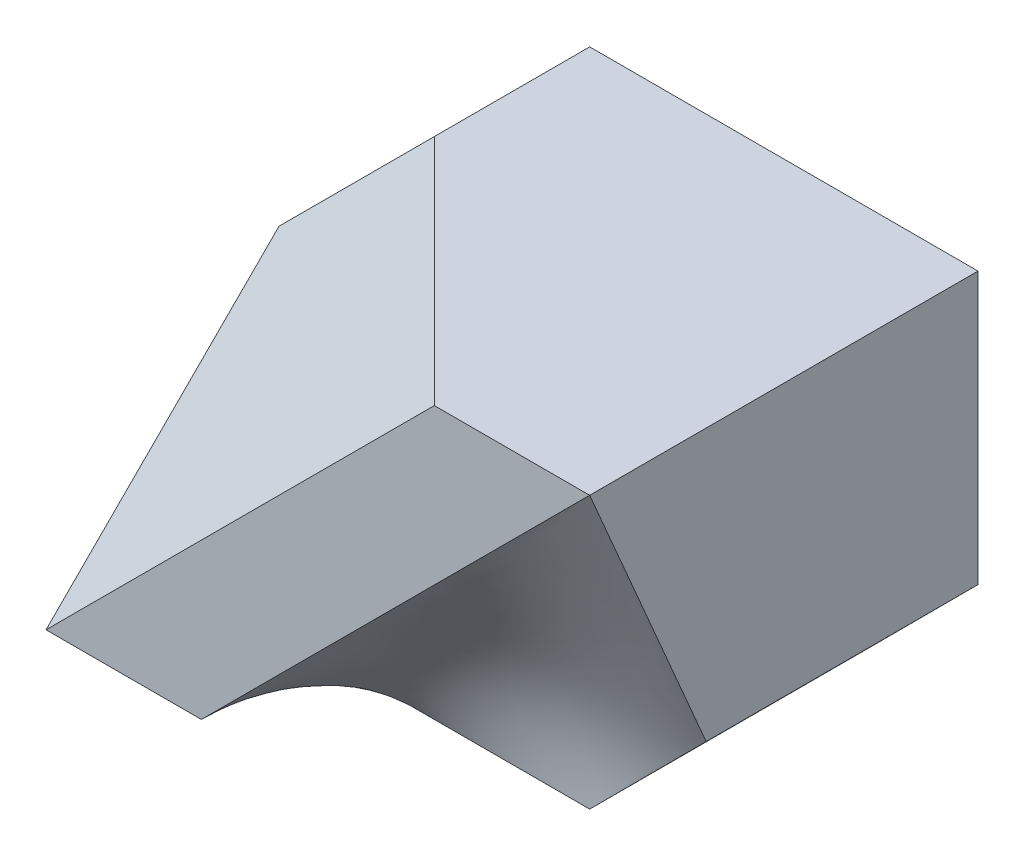
ISO-10303-21;
HEADER;
FILE_DESCRIPTION(('STEP AP214'),'2;1');
FILE_NAME('part.step','',(''),(''),'','','');
FILE_SCHEMA(('AUTOMOTIVE_DESIGN { 1 0 10303 214 1 1 1 1 }'));
ENDSEC;
DATA;
#1=APPLICATION_CONTEXT('core data for automotive mechanical design processes');
#2=APPLICATION_PROTOCOL_DEFINITION('international standard','automotive_design',2000,#1);
#3=PRODUCT_CONTEXT('',#1,'mechanical');
#4=PRODUCT('Part','Part','',(#3));
#5=PRODUCT_RELATED_PRODUCT_CATEGORY('part','',(#4));
#6=PRODUCT_DEFINITION_FORMATION('','',#4);
#7=PRODUCT_DEFINITION_CONTEXT('part definition',#1,'design');
#8=PRODUCT_DEFINITION('design','',#6,#7);
#9=PRODUCT_DEFINITION_SHAPE('','',#8);
#10=(LENGTH_UNIT() NAMED_UNIT(*) SI_UNIT(.MILLI.,.METRE.));
#11=(NAMED_UNIT(*) PLANE_ANGLE_UNIT() SI_UNIT($,.RADIAN.));
#12=(NAMED_UNIT(*) SI_UNIT($,.STERADIAN.) SOLID_ANGLE_UNIT());
#13=UNCERTAINTY_MEASURE_WITH_UNIT(LENGTH_MEASURE(1.E-05),#10,'distance_accuracy_value','');
#14=(GEOMETRIC_REPRESENTATION_CONTEXT(3) GLOBAL_UNCERTAINTY_ASSIGNED_CONTEXT((#13)) GLOBAL_UNIT_ASSIGNED_CONTEXT((#10,
#11,#12)) REPRESENTATION_CONTEXT('',''));
#15=CARTESIAN_POINT('',(0.,0.,0.));
#16=DIRECTION('',(0.,0.,1.));
#17=DIRECTION('',(1.,0.,0.));
#18=AXIS2_PLACEMENT_3D('',#15,#16,#17);
#19=CARTESIAN_POINT('',(0.,5.,0.));
#20=DIRECTION('',(1.,0.,0.));
#21=DIRECTION('',(0.,0.,-1.));
#22=AXIS2_PLACEMENT_3D('',#19,#20,#21);
#23=PLANE('',#22);
#24=DIRECTION('',(0.,-0.707106781186548,0.707106781186548));
#25=VECTOR('',#24,1.);
#26=CARTESIAN_POINT('',(0.,3.,-3.));
#27=LINE('',#26,#25);
#28=CARTESIAN_POINT('',(0.,3.,-3.));
#29=VERTEX_POINT('',#28);
#30=CARTESIAN_POINT('',(0.,0.,0.));
#31=VERTEX_POINT('',#30);
#32=EDGE_CURVE('E198',#29,#31,#27,.T.);
#33=ORIENTED_EDGE('',*,*,#32,.F.);
#34=DIRECTION('',(0.,0.,1.));
#35=VECTOR('',#34,1.);
#36=CARTESIAN_POINT('',(0.,3.,-8.));
#37=LINE('',#36,#35);
#38=CARTESIAN_POINT('',(0.,3.,-5.));
#39=VERTEX_POINT('',#38);
#40=EDGE_CURVE('E201',#39,#29,#37,.T.);
#41=ORIENTED_EDGE('',*,*,#40,.F.);
#42=DIRECTION('',(0.,-1.,0.));
#43=VECTOR('',#42,1.);
#44=CARTESIAN_POINT('',(0.,5.,-5.));
#45=LINE('',#44,#43);
#46=CARTESIAN_POINT('',(0.,0.,-5.));
#47=VERTEX_POINT('',#46);
#48=EDGE_CURVE('E43',#39,#47,#45,.T.);
#49=ORIENTED_EDGE('',*,*,#48,.T.);
#50=DIRECTION('',(0.,0.,1.));
#51=VECTOR('',#50,1.);
#52=CARTESIAN_POINT('',(0.,0.,0.));
#53=LINE('',#52,#51);
#54=EDGE_CURVE('E193',#47,#31,#53,.T.);
#55=ORIENTED_EDGE('',*,*,#54,.T.);
#56=EDGE_LOOP('',(#33,#41,#49,#55));
#57=FACE_BOUND('',#56,.T.);
#58=ADVANCED_FACE('F34',(#57),#23,.F.);
#59=CARTESIAN_POINT('',(0.,5.,0.));
#60=DIRECTION('',(0.,0.,-1.));
#61=DIRECTION('',(-1.,0.,0.));
#62=AXIS2_PLACEMENT_3D('',#59,#60,#61);
#63=PLANE('',#62);
#64=DIRECTION('',(1.,0.,0.));
#65=VECTOR('',#64,1.);
#66=CARTESIAN_POINT('',(0.,0.,0.));
#67=LINE('',#66,#65);
#68=CARTESIAN_POINT('',(1.99984981928856,0.,0.));
#69=VERTEX_POINT('',#68);
#70=EDGE_CURVE('E166',#31,#69,#67,.T.);
#71=ORIENTED_EDGE('',*,*,#70,.T.);
#72=CARTESIAN_POINT('',(7.00000051939584,4.99999911412776,5.8464886362378E-07));
#73=CARTESIAN_POINT('',(6.79169760086642,4.79163298923403,2.6881066073484E-05));
#74=CARTESIAN_POINT('',(6.58335582937833,4.5833057174308,2.08486076384826E-05));
#75=CARTESIAN_POINT('',(6.16666721097387,4.16665983055806,3.07055311247769E-06));
#76=CARTESIAN_POINT('',(5.95832036411651,3.95834121542954,-8.67499387181477E-06));
#77=CARTESIAN_POINT('',(5.54168624780293,3.54163561783001,2.10641272801845E-05));
#78=CARTESIAN_POINT('',(5.3333989796962,3.3332486340095,6.25499183029199E-05));
#79=CARTESIAN_POINT('',(4.91668482104621,2.91663091026343,2.2429077425744E-05));
#80=CARTESIAN_POINT('',(4.70825793640032,2.70840016444011,-5.91726472247832E-05));
#81=CARTESIAN_POINT('',(4.39586238438386,2.39579386538165,2.8506690750941E-05));
#82=CARTESIAN_POINT('',(4.29176749243003,2.29154455018312,9.27530390260116E-05));
#83=CARTESIAN_POINT('',(4.08334834365353,2.08332488065088,9.76156304665399E-06));
#84=CARTESIAN_POINT('',(3.97902414722695,1.97935446590288,-0.000137425999177228));
#85=CARTESIAN_POINT('',(3.77069446319864,1.77100872473797,-0.000130745577507803));
#86=CARTESIAN_POINT('',(3.66668912555008,1.66663324840783,2.32471630026532E-05));
#87=CARTESIAN_POINT('',(3.45850014398936,1.45810693003371,0.000163592992704498));
#88=CARTESIAN_POINT('',(3.35431654512507,1.35395604299685,0.000149983542511541));
#89=CARTESIAN_POINT('',(3.14587969090361,1.14576640208543,4.71327544233279E-05));
#90=CARTESIAN_POINT('',(3.04162645394798,1.04172762975979,-4.20932512759735E-05));
#91=CARTESIAN_POINT('',(2.83317967209512,0.833553623268026,-0.000155578891899759));
#92=CARTESIAN_POINT('',(2.72898614086999,0.729418375386533,-0.000179827132516686));
#93=CARTESIAN_POINT('',(2.52076964385774,0.520919210387798,-6.22257575301078E-05));
#94=CARTESIAN_POINT('',(2.41674673403679,0.41655523737829,7.96703957363885E-05));
#95=CARTESIAN_POINT('',(2.20854784009379,0.208088222304894,0.000191219687153432));
#96=CARTESIAN_POINT('',(2.10437196306181,0.103985073149104,0.000160961933713891));
#97=CARTESIAN_POINT('',(1.99988962194016,0.000188259849773682,-0.000124245512319384));
#98=B_SPLINE_CURVE_WITH_KNOTS('',3,(#72,#73,#74,#75,#76,#77,#78,#79,#80,#81,#82,#83,#84,#85,#86,
#87,#88,#89,#90,#91,#92,#93,#94,#95,#96,#97),.UNSPECIFIED.,.F.,.F.,(4,2,2,2,2,2,2,2,2,2,2,2,4),
(0.,0.883888518478498,1.76776943964939,2.65166900611943,3.53553333423944,3.97749812094542,
4.41935786124811,4.86140066996898,5.30334467989075,5.74519910160827,6.1871310005337,
6.62918671584713,7.07101363997103),.UNSPECIFIED.);
#99=CARTESIAN_POINT('',(7.00000020775834,4.9999996456511,2.33859545320359E-07));
#100=VERTEX_POINT('',#99);
#101=EDGE_CURVE('E102',#100,#69,#98,.T.);
#102=ORIENTED_EDGE('',*,*,#101,.F.);
#103=DIRECTION('',(1.,0.,0.));
#104=VECTOR('',#103,1.);
#105=CARTESIAN_POINT('',(0.,5.,0.));
#106=LINE('',#105,#104);
#107=CARTESIAN_POINT('',(5.,5.,0.));
#108=VERTEX_POINT('',#107);
#109=EDGE_CURVE('E161',#108,#100,#106,.T.);
#110=ORIENTED_EDGE('',*,*,#109,.F.);
#111=DIRECTION('',(0.707106781186548,0.707106781186548,0.));
#112=VECTOR('',#111,1.);
#113=CARTESIAN_POINT('',(0.,0.,0.));
#114=LINE('',#113,#112);
#115=EDGE_CURVE('E60',#31,#108,#114,.T.);
#116=ORIENTED_EDGE('',*,*,#115,.F.);
#117=EDGE_LOOP('',(#71,#102,#110,#116));
#118=FACE_BOUND('',#117,.T.);
#119=ADVANCED_FACE('F147',(#118),#63,.F.);
#120=CARTESIAN_POINT('',(7.,5.,0.));
#121=DIRECTION('',(-1.,0.,0.));
#122=DIRECTION('',(0.,0.,1.));
#123=AXIS2_PLACEMENT_3D('',#120,#121,#122);
#124=PLANE('',#123);
#125=DIRECTION('',(0.,0.,-1.));
#126=VECTOR('',#125,1.);
#127=CARTESIAN_POINT('',(7.,5.,0.));
#128=LINE('',#127,#126);
#129=CARTESIAN_POINT('',(7.,5.,-5.));
#130=VERTEX_POINT('',#129);
#131=EDGE_CURVE('E153',#100,#130,#128,.T.);
#132=ORIENTED_EDGE('',*,*,#131,.F.);
#133=CARTESIAN_POINT('',(7.00013028983176,1.50329950144448,-1.49985334156684));
#134=CARTESIAN_POINT('',(6.99987053731266,1.57640620031426,-1.46897278829298));
#135=CARTESIAN_POINT('',(6.99983181436362,1.64936413848809,-1.43774552845978));
#136=CARTESIAN_POINT('',(6.99991389709435,1.7950079690713,-1.37511141959414));
#137=CARTESIAN_POINT('',(7.00003434263757,1.86769410373661,-1.34370513552639));
#138=CARTESIAN_POINT('',(7.00021338367328,2.08605219334107,-1.24969630076333));
#139=CARTESIAN_POINT('',(7.00008894720091,2.23184750591644,-1.18738078043938));
#140=CARTESIAN_POINT('',(6.99995447979837,2.52336013807165,-1.06257070991984));
#141=CARTESIAN_POINT('',(6.99994444818489,2.66907745811213,-1.00007616079579));
#142=CARTESIAN_POINT('',(6.99995950781141,2.96044852888257,-0.875049099168589));
#143=CARTESIAN_POINT('',(6.9999845894167,3.10610228608517,-0.812516601783507));
#144=CARTESIAN_POINT('',(7.00001214384341,3.39743582443856,-0.687482434683502));
#145=CARTESIAN_POINT('',(7.00001461498595,3.54311560671865,-0.62498076760235));
#146=CARTESIAN_POINT('',(7.00001203029011,3.83448937793604,-0.499985318844777));
#147=CARTESIAN_POINT('',(7.00000697397952,3.98018336719126,-0.437491537909036));
#148=CARTESIAN_POINT('',(6.99999648067793,4.27157182368312,-0.312504478032066));
#149=CARTESIAN_POINT('',(6.99999104368635,4.41726629092014,-0.25001119909175));
#150=CARTESIAN_POINT('',(6.99998792854716,4.70864199271928,-0.125015907318116));
#151=CARTESIAN_POINT('',(6.99999024997293,4.8543232275685,-0.0625138951540346));
#152=CARTESIAN_POINT('',(7.00000051939584,4.99999911412776,5.8464886362378E-07));
#153=B_SPLINE_CURVE_WITH_KNOTS('',3,(#133,#134,#135,#136,#137,#138,#139,#140,#141,#142,#143,
#144,#145,#146,#147,#148,#149,#150,#151,#152),.UNSPECIFIED.,.F.,.F.,(4,2,2,2,2,2,2,2,2,4),(0.,
0.238080371941876,0.475622981612103,0.951285428503773,1.42694503433517,1.90247414961511,
2.37803857377614,2.85363283253664,3.32922781713846,3.80479664921448),.UNSPECIFIED.);
#154=CARTESIAN_POINT('',(7.00000030793014,1.50352119627055,-1.4998533923956));
#155=VERTEX_POINT('',#154);
#156=EDGE_CURVE('E167',#155,#100,#153,.T.);
#157=ORIENTED_EDGE('',*,*,#156,.F.);
#158=DIRECTION('',(0.,0.,1.));
#159=VECTOR('',#158,1.);
#160=CARTESIAN_POINT('',(7.,1.50352172147073,-5.));
#161=LINE('',#160,#159);
#162=CARTESIAN_POINT('',(7.,1.50352172147073,-5.));
#163=VERTEX_POINT('',#162);
#164=EDGE_CURVE('E179',#163,#155,#161,.T.);
#165=ORIENTED_EDGE('',*,*,#164,.F.);
#166=DIRECTION('',(0.,-1.,0.));
#167=VECTOR('',#166,1.);
#168=CARTESIAN_POINT('',(7.,5.,-5.));
#169=LINE('',#168,#167);
#170=EDGE_CURVE('E12',#130,#163,#169,.T.);
#171=ORIENTED_EDGE('',*,*,#170,.F.);
#172=EDGE_LOOP('',(#132,#157,#165,#171));
#173=FACE_BOUND('',#172,.T.);
#174=ADVANCED_FACE('F143',(#173),#124,.F.);
#175=CARTESIAN_POINT('',(0.,5.,-5.));
#176=DIRECTION('',(0.,0.,1.));
#177=DIRECTION('',(1.,0.,0.));
#178=AXIS2_PLACEMENT_3D('',#175,#176,#177);
#179=PLANE('',#178);
#180=ORIENTED_EDGE('',*,*,#170,.T.);
#181=DIRECTION('',(-0.706277191262264,-0.707935398961436,0.));
#182=VECTOR('',#181,1.);
#183=CARTESIAN_POINT('',(5.5,0.,-5.));
#184=LINE('',#183,#182);
#185=CARTESIAN_POINT('',(5.5,0.,-5.));
#186=VERTEX_POINT('',#185);
#187=EDGE_CURVE('E108',#163,#186,#184,.T.);
#188=ORIENTED_EDGE('',*,*,#187,.T.);
#189=DIRECTION('',(-1.,0.,0.));
#190=VECTOR('',#189,1.);
#191=CARTESIAN_POINT('',(0.,0.,-5.));
#192=LINE('',#191,#190);
#193=EDGE_CURVE('E174',#186,#47,#192,.T.);
#194=ORIENTED_EDGE('',*,*,#193,.T.);
#195=ORIENTED_EDGE('',*,*,#48,.F.);
#196=DIRECTION('',(0.707106781186547,0.707106781186548,0.));
#197=VECTOR('',#196,1.);
#198=CARTESIAN_POINT('',(1.,4.,-5.));
#199=LINE('',#198,#197);
#200=CARTESIAN_POINT('',(2.,5.,-5.));
#201=VERTEX_POINT('',#200);
#202=EDGE_CURVE('E183',#39,#201,#199,.T.);
#203=ORIENTED_EDGE('',*,*,#202,.T.);
#204=DIRECTION('',(-1.,0.,0.));
#205=VECTOR('',#204,1.);
#206=CARTESIAN_POINT('',(0.,5.,-5.));
#207=LINE('',#206,#205);
#208=EDGE_CURVE('E160',#130,#201,#207,.T.);
#209=ORIENTED_EDGE('',*,*,#208,.F.);
#210=EDGE_LOOP('',(#180,#188,#194,#195,#203,#209));
#211=FACE_BOUND('',#210,.T.);
#212=ADVANCED_FACE('F139',(#211),#179,.F.);
#213=CARTESIAN_POINT('',(0.,5.,0.));
#214=DIRECTION('',(0.,-1.,0.));
#215=DIRECTION('',(0.,0.,-1.));
#216=AXIS2_PLACEMENT_3D('',#213,#214,#215);
#217=PLANE('',#216);
#218=ORIENTED_EDGE('',*,*,#208,.T.);
#219=DIRECTION('',(0.,0.,1.));
#220=VECTOR('',#219,1.);
#221=CARTESIAN_POINT('',(2.,5.,-8.));
#222=LINE('',#221,#220);
#223=CARTESIAN_POINT('',(2.,5.,-3.));
#224=VERTEX_POINT('',#223);
#225=EDGE_CURVE('E203',#201,#224,#222,.T.);
#226=ORIENTED_EDGE('',*,*,#225,.T.);
#227=DIRECTION('',(-0.707106781186548,0.,-0.707106781186548));
#228=VECTOR('',#227,1.);
#229=CARTESIAN_POINT('',(5.,5.,0.));
#230=LINE('',#229,#228);
#231=EDGE_CURVE('E173',#108,#224,#230,.T.);
#232=ORIENTED_EDGE('',*,*,#231,.F.);
#233=ORIENTED_EDGE('',*,*,#109,.T.);
#234=ORIENTED_EDGE('',*,*,#131,.T.);
#235=EDGE_LOOP('',(#218,#226,#232,#233,#234));
#236=FACE_BOUND('',#235,.T.);
#237=ADVANCED_FACE('F137',(#236),#217,.F.);
#238=CARTESIAN_POINT('',(0.,0.,0.));
#239=DIRECTION('',(0.,-1.,0.));
#240=DIRECTION('',(0.,0.,-1.));
#241=AXIS2_PLACEMENT_3D('',#238,#239,#240);
#242=PLANE('',#241);
#243=CARTESIAN_POINT('',(2.00017425080542,-0.000297199083212959,-1.4998038576783));
#244=CARTESIAN_POINT('',(2.14593490496849,9.88835646775374E-05,-1.50006526013386));
#245=CARTESIAN_POINT('',(2.29169560051284,0.000138379792406398,-1.50009132643838));
#246=CARTESIAN_POINT('',(2.58333821495265,1.05770796548378E-05,-1.50000698054966));
#247=CARTESIAN_POINT('',(2.7292201338829,-0.000156893812023835,-1.49989645487389));
#248=CARTESIAN_POINT('',(3.02089790010589,-0.000191216508999257,-1.49987380294173));
#249=CARTESIAN_POINT('',(3.16669374739809,-5.82456257751158E-05,-1.49996155966517));
#250=CARTESIAN_POINT('',(3.45831397697933,9.36926083048927E-05,-1.50006183426113));
#251=CARTESIAN_POINT('',(3.60413835927548,0.000112637669906985,-1.50007433742341));
#252=CARTESIAN_POINT('',(3.89583240557471,1.44975026146919E-05,-1.50000956790913));
#253=CARTESIAN_POINT('',(4.04170206956762,-0.00010262999905083,-1.49993226733383));
#254=CARTESIAN_POINT('',(4.33337071290556,-0.000142034947201997,-1.49990626127104));
#255=CARTESIAN_POINT('',(4.47916969225642,-6.440676942848E-05,-1.49995749349846));
#256=CARTESIAN_POINT('',(4.77080102572585,0.000171141781980612,-1.50011294835131));
#257=CARTESIAN_POINT('',(4.91663337986561,0.000329080480138721,-1.50021718307037));
#258=CARTESIAN_POINT('',(5.13546101049025,-7.66922425918587E-05,-1.49994938546123));
#259=CARTESIAN_POINT('',(5.20845638359376,-0.000319369829822889,-1.49978922566238));
#260=CARTESIAN_POINT('',(5.35419235596798,-0.000367544606246524,-1.49975743178067));
#261=CARTESIAN_POINT('',(5.4269329577379,-0.000174560434371139,-1.49988479544248));
#262=CARTESIAN_POINT('',(5.49967287838551,0.000557932823847803,-1.50036821863057));
#263=B_SPLINE_CURVE_WITH_KNOTS('',3,(#243,#244,#245,#246,#247,#248,#249,#250,#251,#252,#253,
#254,#255,#256,#257,#258,#259,#260,#261,#262),.UNSPECIFIED.,.F.,.F.,(4,2,2,2,2,2,2,2,2,4),(0.,
0.437282292962484,0.874928130574072,1.31231575056449,1.74978886633978,2.18739792537096,
2.62479496644529,3.06229185360262,3.28127817567389,3.4995023297681),.UNSPECIFIED.);
#264=CARTESIAN_POINT('',(2.00004356270136,-7.42997708032505E-05,-1.49990192883915));
#265=VERTEX_POINT('',#264);
#266=CARTESIAN_POINT('',(5.49996684522126,5.65482025854803E-05,-1.50019067146142));
#267=VERTEX_POINT('',#266);
#268=EDGE_CURVE('E51',#265,#267,#263,.T.);
#269=ORIENTED_EDGE('',*,*,#268,.F.);
#270=CARTESIAN_POINT('',(1.9998896215736,0.000188259486399604,-0.000124245513640978));
#271=CARTESIAN_POINT('',(1.99989627007279,0.00017691992409792,-0.0626310047670829));
#272=CARTESIAN_POINT('',(1.99988325616472,0.000199116214882105,-0.125137775722265));
#273=CARTESIAN_POINT('',(1.99985991616375,0.000238924506574251,-0.250148293431374));
#274=CARTESIAN_POINT('',(1.99984958994081,0.000256536729284742,-0.312652040185263));
#275=CARTESIAN_POINT('',(1.99987362320691,0.000215546016872894,-0.437621843809075));
#276=CARTESIAN_POINT('',(1.99990795576974,0.000156989006632626,-0.500087900692152));
#277=CARTESIAN_POINT('',(1.99999623450903,6.42235461481936E-06,-0.625002799609203));
#278=CARTESIAN_POINT('',(2.00005017530347,-8.55781076910613E-05,-0.687451641665739));
#279=CARTESIAN_POINT('',(2.00012654399405,-0.000215831191862414,-0.812382238459319));
#280=CARTESIAN_POINT('',(2.00014895533467,-0.000254055576936749,-0.874863993266808));
#281=CARTESIAN_POINT('',(2.00012520718447,-0.000213551153158873,-0.999895379900779));
#282=CARTESIAN_POINT('',(2.00007897304692,-0.000134695028162226,-1.06244501160003));
#283=CARTESIAN_POINT('',(1.99993050356983,0.000118531878712471,-1.18756506146455));
#284=CARTESIAN_POINT('',(1.99982824964163,0.00029293436506722,-1.25013547963595));
#285=CARTESIAN_POINT('',(1.99980623931805,0.000330474782587488,-1.37507199395247));
#286=CARTESIAN_POINT('',(1.99988588901269,0.000194625676082254,-1.43743809115272));
#287=CARTESIAN_POINT('',(2.00017425080542,-0.000297199083212954,-1.4998038576783));
#288=B_SPLINE_CURVE_WITH_KNOTS('',3,(#270,#271,#272,#273,#274,#275,#276,#277,#278,#279,#280,
#281,#282,#283,#284,#285,#286,#287),.UNSPECIFIED.,.F.,.F.,(4,2,2,2,2,2,2,2,4),(0.,
0.187520304946241,0.375031534937099,0.562429760759208,0.749776588794299,0.937221752401888,
1.12487089770322,1.3125823470467,1.49968180055761),.UNSPECIFIED.);
#289=EDGE_CURVE('E98',#69,#265,#288,.T.);
#290=ORIENTED_EDGE('',*,*,#289,.F.);
#291=ORIENTED_EDGE('',*,*,#70,.F.);
#292=ORIENTED_EDGE('',*,*,#54,.F.);
#293=ORIENTED_EDGE('',*,*,#193,.F.);
#294=DIRECTION('',(0.,0.,1.));
#295=VECTOR('',#294,1.);
#296=CARTESIAN_POINT('',(5.5,0.,-5.));
#297=LINE('',#296,#295);
#298=EDGE_CURVE('E115',#186,#267,#297,.T.);
#299=ORIENTED_EDGE('',*,*,#298,.T.);
#300=EDGE_LOOP('',(#269,#290,#291,#292,#293,#299));
#301=FACE_BOUND('',#300,.T.);
#302=ADVANCED_FACE('F113',(#301),#242,.T.);
#303=CARTESIAN_POINT('',(0.,0.,0.));
#304=DIRECTION('',(-0.577350269189627,0.577350269189626,0.577350269189625));
#305=DIRECTION('',(-0.707106781186547,-0.707106781186548,0.));
#306=AXIS2_PLACEMENT_3D('',#303,#304,#305);
#307=PLANE('',#306);
#308=DIRECTION('',(-0.707106781186548,-0.707106781186548,0.));
#309=VECTOR('',#308,1.);
#310=CARTESIAN_POINT('',(2.,5.,-3.));
#311=LINE('',#310,#309);
#312=EDGE_CURVE('E218',#224,#29,#311,.T.);
#313=ORIENTED_EDGE('',*,*,#312,.T.);
#314=ORIENTED_EDGE('',*,*,#32,.T.);
#315=ORIENTED_EDGE('',*,*,#115,.T.);
#316=ORIENTED_EDGE('',*,*,#231,.T.);
#317=EDGE_LOOP('',(#313,#314,#315,#316));
#318=FACE_BOUND('',#317,.T.);
#319=ADVANCED_FACE('F136',(#318),#307,.T.);
#320=CARTESIAN_POINT('',(0.,3.,-8.));
#321=DIRECTION('',(0.707106781186548,-0.707106781186547,0.));
#322=DIRECTION('',(0.707106781186547,0.707106781186548,0.));
#323=AXIS2_PLACEMENT_3D('',#320,#321,#322);
#324=PLANE('',#323);
#325=ORIENTED_EDGE('',*,*,#40,.T.);
#326=ORIENTED_EDGE('',*,*,#312,.F.);
#327=ORIENTED_EDGE('',*,*,#225,.F.);
#328=ORIENTED_EDGE('',*,*,#202,.F.);
#329=EDGE_LOOP('',(#325,#326,#327,#328));
#330=FACE_BOUND('',#329,.T.);
#331=ADVANCED_FACE('F293',(#330),#324,.F.);
#332=CARTESIAN_POINT('',(5.5,0.,-5.));
#333=DIRECTION('',(-0.707935398961436,0.706277191262264,0.));
#334=DIRECTION('',(-0.706277191262264,-0.707935398961436,0.));
#335=AXIS2_PLACEMENT_3D('',#332,#333,#334);
#336=PLANE('',#335);
#337=ORIENTED_EDGE('',*,*,#164,.T.);
#338=CARTESIAN_POINT('',(5.49967287838551,0.000557932823846681,-1.50036821863057));
#339=CARTESIAN_POINT('',(5.53138682004707,0.0312735418631798,-1.49992228089889));
#340=CARTESIAN_POINT('',(5.56278642067275,0.0623061988059766,-1.4997391056642));
#341=CARTESIAN_POINT('',(5.62534696245436,0.124778881046126,-1.49964152892207));
#342=CARTESIAN_POINT('',(5.65650704444963,0.156219771654406,-1.49972784508138));
#343=CARTESIAN_POINT('',(5.749981422625,0.250578750091972,-1.5000043303478));
#344=CARTESIAN_POINT('',(5.81227407847228,0.313517251232355,-1.50021200143093));
#345=CARTESIAN_POINT('',(5.93724793716712,0.438863584305846,-1.50024486465684));
#346=CARTESIAN_POINT('',(5.99992860917835,0.501271944450701,-1.50007049754272));
#347=CARTESIAN_POINT('',(6.12517548867201,0.626234769549013,-1.49983018847261));
#348=CARTESIAN_POINT('',(6.18774166305734,0.688789267570484,-1.49976427405242));
#349=CARTESIAN_POINT('',(6.31261668879342,0.814247755736915,-1.4998849372349));
#350=CARTESIAN_POINT('',(6.37492531272278,0.877151972257078,-1.50007170369365));
#351=CARTESIAN_POINT('',(6.49978376047794,1.00264750424514,-1.50021467256315));
#352=CARTESIAN_POINT('',(6.56233342215868,1.06523898101901,-1.50017100958423));
#353=CARTESIAN_POINT('',(6.68744663852258,1.19037657825932,-1.50005904131787));
#354=CARTESIAN_POINT('',(6.75001018586942,1.25292270613839,-1.4999907421684));
#355=CARTESIAN_POINT('',(6.87510986799224,1.3780617239484,-1.49988500352553));
#356=CARTESIAN_POINT('',(6.93764599703083,1.44065461961622,-1.49984756880735));
#357=CARTESIAN_POINT('',(7.00013028983177,1.50329950144448,-1.49985334156684));
#358=B_SPLINE_CURVE_WITH_KNOTS('',3,(#338,#339,#340,#341,#342,#343,#344,#345,#346,#347,#348,
#349,#350,#351,#352,#353,#354,#355,#356,#357),.UNSPECIFIED.,.F.,.F.,(4,2,2,2,2,2,2,2,2,4),(0.,
0.132443201657419,0.265239405597155,0.530898985257973,0.796252244842557,1.06167286641831,
1.32729197552017,1.59275593465604,1.85815380034495,2.12359271959109),.UNSPECIFIED.);
#359=EDGE_CURVE('E116',#267,#155,#358,.T.);
#360=ORIENTED_EDGE('',*,*,#359,.F.);
#361=ORIENTED_EDGE('',*,*,#298,.F.);
#362=ORIENTED_EDGE('',*,*,#187,.F.);
#363=EDGE_LOOP('',(#337,#360,#361,#362));
#364=FACE_BOUND('',#363,.T.);
#365=ADVANCED_FACE('F249',(#364),#336,.F.);
#366=CARTESIAN_POINT('',(1.82671673052231,-0.175894545052289,0.0373256603041488));
#367=CARTESIAN_POINT('',(1.83369480001195,-0.121216325743138,-0.289754247686206));
#368=CARTESIAN_POINT('',(1.84281842440846,-0.0701975268295572,-0.614419049934007));
#369=CARTESIAN_POINT('',(1.86594012459968,-0.0430535977214307,-0.923327166988726));
#370=CARTESIAN_POINT('',(1.89594464858744,0.0122894364469745,-1.42540021450018));
#371=CARTESIAN_POINT('',(1.96489673549169,0.00120419807926209,-1.88363263013303));
#372=CARTESIAN_POINT('',(2.00111288069946,-0.020627089603336,-2.04377902876254));
#373=CARTESIAN_POINT('',(2.07475250593969,-0.081947659074202,-2.28424206598031));
#374=CARTESIAN_POINT('',(2.1761824358822,-0.190666879356302,-2.49342344070006));
#375=CARTESIAN_POINT('',(2.21863819743533,-0.238739131253608,-2.56807558104652));
#376=CARTESIAN_POINT('',(2.2652546415199,-0.293907769482656,-2.63804432306022));
#377=CARTESIAN_POINT('',(2.31596865490667,-0.356065149239027,-2.70340070902576));
#378=CARTESIAN_POINT('',(2.25310431922535,0.255487773171536,0.0346979429725722));
#379=CARTESIAN_POINT('',(2.30745713992794,0.22936445705083,-0.239055418430787));
#380=CARTESIAN_POINT('',(2.37066165556338,0.188143847046426,-0.502845026777722));
#381=CARTESIAN_POINT('',(2.43450013165419,0.145841965333147,-0.765921028806035));
#382=CARTESIAN_POINT('',(2.56669084685932,0.0268980441360901,-1.1529700065983));
#383=CARTESIAN_POINT('',(2.71603808237818,-0.121307733819414,-1.52070705226676));
#384=CARTESIAN_POINT('',(2.77671982735645,-0.184867114548844,-1.65331418340592));
#385=CARTESIAN_POINT('',(2.89369011781882,-0.320091698109456,-1.84500282754593));
#386=CARTESIAN_POINT('',(3.0378275051126,-0.501652000190218,-2.00611131204999));
#387=CARTESIAN_POINT('',(3.096445805734,-0.577290792063457,-2.06257037759344));
#388=CARTESIAN_POINT('',(3.15859316844753,-0.658948689649663,-2.11505701712419));
#389=CARTESIAN_POINT('',(3.22475971245849,-0.747461631572571,-2.16301953667099));
#390=CARTESIAN_POINT('',(2.67270667074925,0.698442871585947,0.0244325440212198));
#391=CARTESIAN_POINT('',(2.75002415564132,0.633151431524708,-0.223471051348274));
#392=CARTESIAN_POINT('',(2.83750759738219,0.55052111576572,-0.459931518096934));
#393=CARTESIAN_POINT('',(2.93887227508837,0.444215210142139,-0.68076681832993));
#394=CARTESIAN_POINT('',(3.10116352751401,0.273932346525342,-1.03393366145513));
#395=CARTESIAN_POINT('',(3.32348969200814,0.0012550016637403,-1.31952327296868));
#396=CARTESIAN_POINT('',(3.4148356025234,-0.11460463594507,-1.41761383124572));
#397=CARTESIAN_POINT('',(3.57113988013975,-0.316916570368485,-1.56502687193189));
#398=CARTESIAN_POINT('',(3.75545517182579,-0.567003593585334,-1.68090981254354));
#399=CARTESIAN_POINT('',(3.8301741324998,-0.670103385683045,-1.71924545629798));
#400=CARTESIAN_POINT('',(3.91154085842855,-0.784541488294246,-1.75009816126157));
#401=CARTESIAN_POINT('',(3.99825628618684,-0.90810224188119,-1.7749301950872));
#402=CARTESIAN_POINT('',(3.10778612381226,1.11500050011624,0.0315886693032969));
#403=CARTESIAN_POINT('',(3.17335270060359,1.06975120049778,-0.229542126890022));
#404=CARTESIAN_POINT('',(3.25400464446254,0.998772566362924,-0.473692347795812));
#405=CARTESIAN_POINT('',(3.34849805176623,0.904186177669071,-0.702262171415398));
#406=CARTESIAN_POINT('',(3.54001100876245,0.684063293012697,-1.02253612222498));
#407=CARTESIAN_POINT('',(3.80039771188638,0.346470568506536,-1.26528356498045));
#408=CARTESIAN_POINT('',(3.91020309375072,0.199126783961304,-1.34259554746236));
#409=CARTESIAN_POINT('',(4.11063107757359,-0.0784417611885009,-1.44034152258419));
#410=CARTESIAN_POINT('',(4.33906522873014,-0.403777128625788,-1.50656285327426));
#411=CARTESIAN_POINT('',(4.42866643232551,-0.53225981029849,-1.52814656482569));
#412=CARTESIAN_POINT('',(4.51916670337061,-0.662275925467869,-1.54871825708388));
#413=CARTESIAN_POINT('',(4.6120901512514,-0.796424968070864,-1.56656234341059));
#414=CARTESIAN_POINT('',(3.7060558080882,1.72254923597656,0.0269558288018945));
#415=CARTESIAN_POINT('',(3.7739465479133,1.67333588510885,-0.231558814585321));
#416=CARTESIAN_POINT('',(3.85758496309966,1.597263578446,-0.472347367127087));
#417=CARTESIAN_POINT('',(3.95740439927851,1.49359320936498,-0.694922041016984));
#418=CARTESIAN_POINT('',(4.14567880277523,1.27899394411886,-1.01884141200582));
#419=CARTESIAN_POINT('',(4.40603202682242,0.941458320931727,-1.26162653988824));
#420=CARTESIAN_POINT('',(4.51501155324831,0.795523100775424,-1.33986813186409));
#421=CARTESIAN_POINT('',(4.71169697940585,0.524337795600705,-1.44182685049525));
#422=CARTESIAN_POINT('',(4.95670312396617,0.170737530135225,-1.48939421138755));
#423=CARTESIAN_POINT('',(5.05753675877269,0.0230970130072363,-1.4983343364097));
#424=CARTESIAN_POINT('',(5.16926038312722,-0.14311727714874,-1.49501633827347));
#425=CARTESIAN_POINT('',(5.29042263575772,-0.325429924288581,-1.48107391599585));
#426=CARTESIAN_POINT('',(4.30775808939111,2.32424339522787,0.0261868301279813));
#427=CARTESIAN_POINT('',(4.39230849985432,2.24661560559587,-0.213575151141607));
#428=CARTESIAN_POINT('',(4.49129523074166,2.14436548389116,-0.437087144940776));
#429=CARTESIAN_POINT('',(4.60465944578821,2.01759338020387,-0.644415379265086));
#430=CARTESIAN_POINT('',(4.8131030635796,1.76859386077751,-0.945631632703573));
#431=CARTESIAN_POINT('',(5.07646291219669,1.42593019204994,-1.18503240708398));
#432=CARTESIAN_POINT('',(5.1841188654428,1.28225243483389,-1.26476385568246));
#433=CARTESIAN_POINT('',(5.37461023830415,1.02163159710397,-1.37369480030355));
#434=CARTESIAN_POINT('',(5.594576545152,0.71073883473401,-1.44944780941812));
#435=CARTESIAN_POINT('',(5.68232526060486,0.585415723981487,-1.4731167413179));
#436=CARTESIAN_POINT('',(5.7738974281443,0.453571401162772,-1.49248187234068));
#437=CARTESIAN_POINT('',(5.86960570577298,0.314672602333885,-1.50719126456347));
#438=CARTESIAN_POINT('',(4.47986983181026,2.50001813127611,0.0244402048490986));
#439=CARTESIAN_POINT('',(4.57165318735603,2.41005395879465,-0.207180140358421));
#440=CARTESIAN_POINT('',(4.67712397047759,2.29674475260035,-0.42339347601794));
#441=CARTESIAN_POINT('',(4.79627042857498,2.160110557719,-0.624213031235181));
#442=CARTESIAN_POINT('',(5.01208361928501,1.89854162543029,-0.917133855916849));
#443=CARTESIAN_POINT('',(5.27778165459962,1.55188998694087,-1.15390269200381));
#444=CARTESIAN_POINT('',(5.38506059486216,1.4088552563831,-1.23405851856561));
#445=CARTESIAN_POINT('',(5.57191698110129,1.1544341873657,-1.34708112126373));
#446=CARTESIAN_POINT('',(5.78355542629099,0.857745278137014,-1.43220823982068));
#447=CARTESIAN_POINT('',(5.86735831293889,0.739152103010965,-1.46031872377519));
#448=CARTESIAN_POINT('',(5.95478993705131,0.614369817624777,-1.48434458390585));
#449=CARTESIAN_POINT('',(6.04585253692152,0.483394604385157,-1.50428330071761));
#450=CARTESIAN_POINT('',(5.09404553211618,3.1201663431117,0.0211641703024701));
#451=CARTESIAN_POINT('',(5.21272876131572,2.98432222322294,-0.180176810288893));
#452=CARTESIAN_POINT('',(5.3426152440041,2.82937003288511,-0.368907047736595));
#453=CARTESIAN_POINT('',(5.48348594661967,2.65568335185626,-0.545273093274121));
#454=CARTESIAN_POINT('',(5.72932529118698,2.34290234408964,-0.80439551159958));
#455=CARTESIAN_POINT('',(6.00159913731241,1.98503511931176,-1.03376240313671));
#456=CARTESIAN_POINT('',(6.10723641496894,1.84480037937795,-1.1157661380293));
#457=CARTESIAN_POINT('',(6.27952014710232,1.61523417074271,-1.24519218978337));
#458=CARTESIAN_POINT('',(6.45306313567696,1.38352019665523,-1.37320078190833));
#459=CARTESIAN_POINT('',(6.51891657571308,1.29554127931876,-1.42151574137865));
#460=CARTESIAN_POINT('',(6.58570792476698,1.20596268099628,-1.46877496023497));
#461=CARTESIAN_POINT('',(6.65306781279464,1.1154143926837,-1.51539421330159));
#462=CARTESIAN_POINT('',(5.70738185960221,3.74174617434421,0.0169433106592673));
#463=CARTESIAN_POINT('',(5.8549553045568,3.55662741486065,-0.151877912109065));
#464=CARTESIAN_POINT('',(6.00928080564159,3.35999246819543,-0.313098802915564));
#465=CARTESIAN_POINT('',(6.1705367802245,3.15153702885051,-0.46651852942445));
#466=CARTESIAN_POINT('',(6.43741283795429,2.80287617622758,-0.701961345520646));
#467=CARTESIAN_POINT('',(6.70916370372706,2.44590093745986,-0.931916920594978));
#468=CARTESIAN_POINT('',(6.81051668645017,2.31297341497831,-1.01874319592326));
#469=CARTESIAN_POINT('',(6.97255931941542,2.1008742434475,-1.15969695891381));
#470=CARTESIAN_POINT('',(7.12192637919428,1.91039430472959,-1.31491875554526));
#471=CARTESIAN_POINT('',(7.17538504987184,1.84355568617726,-1.37718566681923));
#472=CARTESIAN_POINT('',(7.22335968499454,1.78607054140244,-1.44562558523337));
#473=CARTESIAN_POINT('',(7.26704416334084,1.73590261193528,-1.51889464236264));
#474=CARTESIAN_POINT('',(6.15018526038552,4.18485846944092,0.0162462421471485));
#475=CARTESIAN_POINT('',(6.3033631929055,3.99018079536942,-0.146266388820289));
#476=CARTESIAN_POINT('',(6.46053018909248,3.78869944505651,-0.304288801178791));
#477=CARTESIAN_POINT('',(6.62127881489719,3.58110933079133,-0.45827961581918));
#478=CARTESIAN_POINT('',(6.88161975617788,3.24359465686845,-0.70107856957885));
#479=CARTESIAN_POINT('',(7.13861297584333,2.91178979756323,-0.947645826666993));
#480=CARTESIAN_POINT('',(7.23406934827457,2.78891942901287,-1.04110951655415));
#481=CARTESIAN_POINT('',(7.38469348265133,2.59629544615644,-1.1949163095095));
#482=CARTESIAN_POINT('',(7.53456711771598,2.40495150161584,-1.34956788867514));
#483=CARTESIAN_POINT('',(7.5917808507572,2.33170831529599,-1.40760798074804));
#484=CARTESIAN_POINT('',(7.65086465455572,2.2552755694601,-1.46354306091472));
#485=CARTESIAN_POINT('',(7.71082165325916,2.17735351788131,-1.51849524475832));
#486=CARTESIAN_POINT('',(6.59296716496399,4.62800742808707,0.0155249768055876));
#487=CARTESIAN_POINT('',(6.74994347431734,4.42685130985416,-0.142712078792999));
#488=CARTESIAN_POINT('',(6.90925706539909,4.22170876536055,-0.298318214761209));
#489=CARTESIAN_POINT('',(7.07142077834076,4.01170510356959,-0.450716161723229));
#490=CARTESIAN_POINT('',(7.33158425540079,3.67449310947985,-0.693714874928384));
#491=CARTESIAN_POINT('',(7.588754355616,3.34238656584324,-0.940083029569799));
#492=CARTESIAN_POINT('',(7.68435093278745,3.21927706657486,-1.03338890048346));
#493=CARTESIAN_POINT('',(7.83660763124448,3.0238686113778,-1.18535802670201));
#494=CARTESIAN_POINT('',(7.98501088506914,2.83503252300117,-1.34166471437367));
#495=CARTESIAN_POINT('',(8.04050536481091,2.76472166461603,-1.40164005336232));
#496=CARTESIAN_POINT('',(8.09483613277513,2.69639561239908,-1.46292530382766));
#497=CARTESIAN_POINT('',(8.14830800656554,2.62953447485167,-1.52517735325237));
#498=CARTESIAN_POINT('',(7.03590543974338,5.07088968449014,0.0149797268079621));
#499=CARTESIAN_POINT('',(7.19490618553442,4.86628072337436,-0.140978557902447));
#500=CARTESIAN_POINT('',(7.35603861488246,4.65803600059071,-0.294537350908341));
#501=CARTESIAN_POINT('',(7.51887461141475,4.4468857038332,-0.446178553794632));
#502=CARTESIAN_POINT('',(7.77881356332789,4.11005665584863,-0.689429999739554));
#503=CARTESIAN_POINT('',(8.0337692465599,3.78172698254421,-0.938290773495197));
#504=CARTESIAN_POINT('',(8.12830597678855,3.66042513942372,-1.03278964228047));
#505=CARTESIAN_POINT('',(8.27820757415146,3.46903350288265,-1.18740974618208));
#506=CARTESIAN_POINT('',(8.42386680988603,3.2848775630924,-1.34680518904012));
#507=CARTESIAN_POINT('',(8.47835442982455,3.21628398692995,-1.40791388186871));
#508=CARTESIAN_POINT('',(8.53219717638362,3.14879029536604,-1.46974846495388));
#509=CARTESIAN_POINT('',(8.58537041682195,3.0824385015673,-1.53233666570297));
#510=B_SPLINE_SURFACE_WITH_KNOTS('',5,5,((#366,#367,#368,#369,#370,#371,#372,#373,#374,#375,
#376,#377),(#378,#379,#380,#381,#382,#383,#384,#385,#386,#387,#388,#389),(#390,#391,#392,#393,
#394,#395,#396,#397,#398,#399,#400,#401),(#402,#403,#404,#405,#406,#407,#408,#409,#410,#411,
#412,#413),(#414,#415,#416,#417,#418,#419,#420,#421,#422,#423,#424,#425),(#426,#427,#428,#429,
#430,#431,#432,#433,#434,#435,#436,#437),(#438,#439,#440,#441,#442,#443,#444,#445,#446,#447,
#448,#449),(#450,#451,#452,#453,#454,#455,#456,#457,#458,#459,#460,#461),(#462,#463,#464,#465,
#466,#467,#468,#469,#470,#471,#472,#473),(#474,#475,#476,#477,#478,#479,#480,#481,#482,#483,
#484,#485),(#486,#487,#488,#489,#490,#491,#492,#493,#494,#495,#496,#497),(#498,#499,#500,#501,
#502,#503,#504,#505,#506,#507,#508,#509)),.UNSPECIFIED.,.F.,.F.,.F.,(6,3,3,6),(6,3,3,6),
(-3.08443670116842,-0.130381011241019,1.06622518524154,4.12157382849622),(-1.30621333298994,
0.0177894736601663,0.8120001082529,1.29601444826852),.UNSPECIFIED.);
#511=ORIENTED_EDGE('',*,*,#289,.T.);
#512=ORIENTED_EDGE('',*,*,#268,.T.);
#513=ORIENTED_EDGE('',*,*,#359,.T.);
#514=ORIENTED_EDGE('',*,*,#156,.T.);
#515=ORIENTED_EDGE('',*,*,#101,.T.);
#516=EDGE_LOOP('',(#511,#512,#513,#514,#515));
#517=FACE_BOUND('',#516,.T.);
#518=ADVANCED_FACE('F100',(#517),#510,.F.);
#519=CLOSED_SHELL('',(#58,#119,#174,#212,#237,#302,#319,#331,#365,#518));
#520=MANIFOLD_SOLID_BREP('B2',#519);
#521=ADVANCED_BREP_SHAPE_REPRESENTATION('',(#18,#520),#14);
#522=SHAPE_DEFINITION_REPRESENTATION(#9,#521);
ENDSEC;
END-ISO-10303-21;
